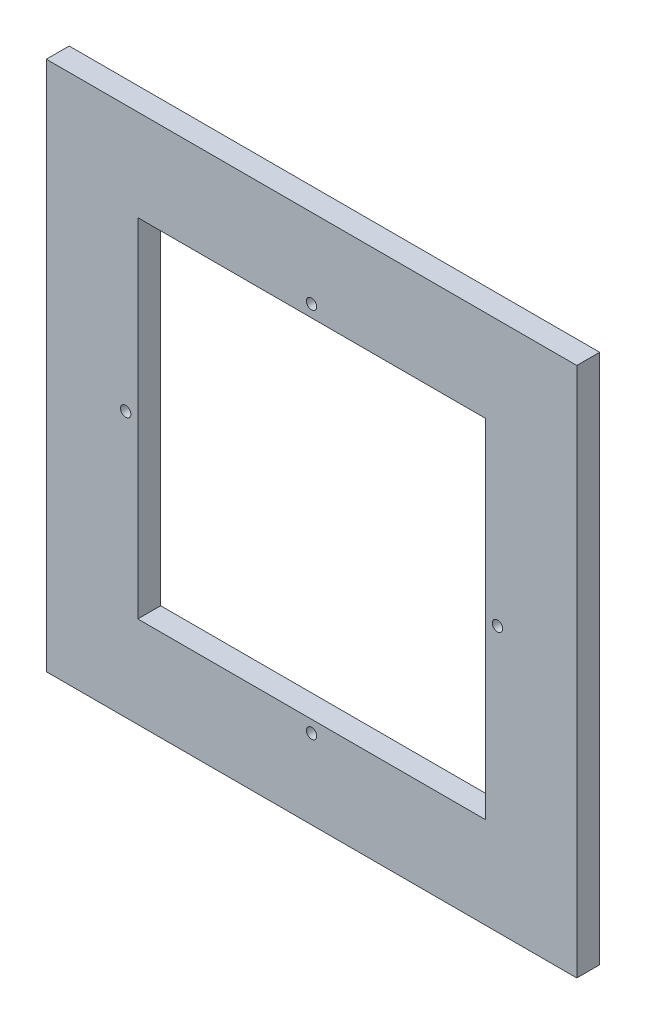
ISO-10303-21;
HEADER;
FILE_DESCRIPTION(('STEP AP214'),'2;1');
FILE_NAME('part.step','',(''),(''),'','','');
FILE_SCHEMA(('AUTOMOTIVE_DESIGN { 1 0 10303 214 1 1 1 1 }'));
ENDSEC;
DATA;
#1=APPLICATION_CONTEXT('core data for automotive mechanical design processes');
#2=APPLICATION_PROTOCOL_DEFINITION('international standard','automotive_design',2000,#1);
#3=PRODUCT_CONTEXT('',#1,'mechanical');
#4=PRODUCT('Part','Part','',(#3));
#5=PRODUCT_RELATED_PRODUCT_CATEGORY('part','',(#4));
#6=PRODUCT_DEFINITION_FORMATION('','',#4);
#7=PRODUCT_DEFINITION_CONTEXT('part definition',#1,'design');
#8=PRODUCT_DEFINITION('design','',#6,#7);
#9=PRODUCT_DEFINITION_SHAPE('','',#8);
#10=(LENGTH_UNIT() NAMED_UNIT(*) SI_UNIT(.MILLI.,.METRE.));
#11=(NAMED_UNIT(*) PLANE_ANGLE_UNIT() SI_UNIT($,.RADIAN.));
#12=(NAMED_UNIT(*) SI_UNIT($,.STERADIAN.) SOLID_ANGLE_UNIT());
#13=UNCERTAINTY_MEASURE_WITH_UNIT(LENGTH_MEASURE(1.E-05),#10,'distance_accuracy_value','');
#14=(GEOMETRIC_REPRESENTATION_CONTEXT(3) GLOBAL_UNCERTAINTY_ASSIGNED_CONTEXT((#13)) GLOBAL_UNIT_ASSIGNED_CONTEXT((#10,
#11,#12)) REPRESENTATION_CONTEXT('',''));
#15=CARTESIAN_POINT('',(0.,0.,0.));
#16=DIRECTION('',(0.,0.,1.));
#17=DIRECTION('',(1.,0.,0.));
#18=AXIS2_PLACEMENT_3D('',#15,#16,#17);
#19=CARTESIAN_POINT('',(73.66,0.,6.35));
#20=DIRECTION('',(1.,0.,0.));
#21=DIRECTION('',(0.,1.,0.));
#22=AXIS2_PLACEMENT_3D('',#19,#20,#21);
#23=PLANE('',#22);
#24=DIRECTION('',(0.,-1.,0.));
#25=VECTOR('',#24,1.);
#26=CARTESIAN_POINT('',(73.66,0.,0.));
#27=LINE('',#26,#25);
#28=CARTESIAN_POINT('',(73.66,73.66,0.));
#29=VERTEX_POINT('',#28);
#30=CARTESIAN_POINT('',(73.66,-73.66,0.));
#31=VERTEX_POINT('',#30);
#32=EDGE_CURVE('E158',#29,#31,#27,.T.);
#33=ORIENTED_EDGE('',*,*,#32,.F.);
#34=DIRECTION('',(0.,0.,-1.));
#35=VECTOR('',#34,1.);
#36=CARTESIAN_POINT('',(73.66,73.66,6.35));
#37=LINE('',#36,#35);
#38=CARTESIAN_POINT('',(73.66,73.66,6.35));
#39=VERTEX_POINT('',#38);
#40=EDGE_CURVE('E11',#39,#29,#37,.T.);
#41=ORIENTED_EDGE('',*,*,#40,.F.);
#42=DIRECTION('',(0.,-1.,0.));
#43=VECTOR('',#42,1.);
#44=CARTESIAN_POINT('',(73.66,0.,6.35));
#45=LINE('',#44,#43);
#46=CARTESIAN_POINT('',(73.66,-73.66,6.35));
#47=VERTEX_POINT('',#46);
#48=EDGE_CURVE('E129',#39,#47,#45,.T.);
#49=ORIENTED_EDGE('',*,*,#48,.T.);
#50=DIRECTION('',(0.,0.,-1.));
#51=VECTOR('',#50,1.);
#52=CARTESIAN_POINT('',(73.66,-73.66,6.35));
#53=LINE('',#52,#51);
#54=EDGE_CURVE('E56',#47,#31,#53,.T.);
#55=ORIENTED_EDGE('',*,*,#54,.T.);
#56=EDGE_LOOP('',(#33,#41,#49,#55));
#57=FACE_BOUND('',#56,.T.);
#58=ADVANCED_FACE('F37',(#57),#23,.T.);
#59=CARTESIAN_POINT('',(0.,73.66,6.35));
#60=DIRECTION('',(0.,1.,0.));
#61=DIRECTION('',(0.,0.,1.));
#62=AXIS2_PLACEMENT_3D('',#59,#60,#61);
#63=PLANE('',#62);
#64=DIRECTION('',(1.,0.,0.));
#65=VECTOR('',#64,1.);
#66=CARTESIAN_POINT('',(0.,73.66,0.));
#67=LINE('',#66,#65);
#68=CARTESIAN_POINT('',(-73.66,73.66,0.));
#69=VERTEX_POINT('',#68);
#70=EDGE_CURVE('E116',#69,#29,#67,.T.);
#71=ORIENTED_EDGE('',*,*,#70,.F.);
#72=DIRECTION('',(0.,0.,-1.));
#73=VECTOR('',#72,1.);
#74=CARTESIAN_POINT('',(-73.66,73.66,6.35));
#75=LINE('',#74,#73);
#76=CARTESIAN_POINT('',(-73.66,73.66,6.35));
#77=VERTEX_POINT('',#76);
#78=EDGE_CURVE('E47',#77,#69,#75,.T.);
#79=ORIENTED_EDGE('',*,*,#78,.F.);
#80=DIRECTION('',(1.,0.,0.));
#81=VECTOR('',#80,1.);
#82=CARTESIAN_POINT('',(0.,73.66,6.35));
#83=LINE('',#82,#81);
#84=EDGE_CURVE('E114',#77,#39,#83,.T.);
#85=ORIENTED_EDGE('',*,*,#84,.T.);
#86=ORIENTED_EDGE('',*,*,#40,.T.);
#87=EDGE_LOOP('',(#71,#79,#85,#86));
#88=FACE_BOUND('',#87,.T.);
#89=ADVANCED_FACE('F112',(#88),#63,.T.);
#90=CARTESIAN_POINT('',(-73.66,0.,6.35));
#91=DIRECTION('',(1.,0.,0.));
#92=DIRECTION('',(0.,0.,-1.));
#93=AXIS2_PLACEMENT_3D('',#90,#91,#92);
#94=PLANE('',#93);
#95=DIRECTION('',(0.,-1.,0.));
#96=VECTOR('',#95,1.);
#97=CARTESIAN_POINT('',(-73.66,0.,0.));
#98=LINE('',#97,#96);
#99=CARTESIAN_POINT('',(-73.66,-73.66,0.));
#100=VERTEX_POINT('',#99);
#101=EDGE_CURVE('E161',#69,#100,#98,.T.);
#102=ORIENTED_EDGE('',*,*,#101,.T.);
#103=DIRECTION('',(0.,0.,-1.));
#104=VECTOR('',#103,1.);
#105=CARTESIAN_POINT('',(-73.66,-73.66,6.35));
#106=LINE('',#105,#104);
#107=CARTESIAN_POINT('',(-73.66,-73.66,6.35));
#108=VERTEX_POINT('',#107);
#109=EDGE_CURVE('E82',#108,#100,#106,.T.);
#110=ORIENTED_EDGE('',*,*,#109,.F.);
#111=DIRECTION('',(0.,-1.,0.));
#112=VECTOR('',#111,1.);
#113=CARTESIAN_POINT('',(-73.66,0.,6.35));
#114=LINE('',#113,#112);
#115=EDGE_CURVE('E120',#77,#108,#114,.T.);
#116=ORIENTED_EDGE('',*,*,#115,.F.);
#117=ORIENTED_EDGE('',*,*,#78,.T.);
#118=EDGE_LOOP('',(#102,#110,#116,#117));
#119=FACE_BOUND('',#118,.T.);
#120=ADVANCED_FACE('F121',(#119),#94,.F.);
#121=CARTESIAN_POINT('',(48.26,0.,6.35));
#122=DIRECTION('',(1.,0.,0.));
#123=DIRECTION('',(0.,1.,0.));
#124=AXIS2_PLACEMENT_3D('',#121,#122,#123);
#125=PLANE('',#124);
#126=DIRECTION('',(0.,-1.,0.));
#127=VECTOR('',#126,1.);
#128=CARTESIAN_POINT('',(48.26,0.,0.));
#129=LINE('',#128,#127);
#130=CARTESIAN_POINT('',(48.26,48.26,0.));
#131=VERTEX_POINT('',#130);
#132=CARTESIAN_POINT('',(48.26,-48.26,0.));
#133=VERTEX_POINT('',#132);
#134=EDGE_CURVE('E146',#131,#133,#129,.T.);
#135=ORIENTED_EDGE('',*,*,#134,.T.);
#136=DIRECTION('',(0.,0.,-1.));
#137=VECTOR('',#136,1.);
#138=CARTESIAN_POINT('',(48.26,-48.26,6.35));
#139=LINE('',#138,#137);
#140=CARTESIAN_POINT('',(48.26,-48.26,6.35));
#141=VERTEX_POINT('',#140);
#142=EDGE_CURVE('E41',#141,#133,#139,.T.);
#143=ORIENTED_EDGE('',*,*,#142,.F.);
#144=DIRECTION('',(0.,-1.,0.));
#145=VECTOR('',#144,1.);
#146=CARTESIAN_POINT('',(48.26,0.,6.35));
#147=LINE('',#146,#145);
#148=CARTESIAN_POINT('',(48.26,48.26,6.35));
#149=VERTEX_POINT('',#148);
#150=EDGE_CURVE('E175',#149,#141,#147,.T.);
#151=ORIENTED_EDGE('',*,*,#150,.F.);
#152=DIRECTION('',(0.,0.,-1.));
#153=VECTOR('',#152,1.);
#154=CARTESIAN_POINT('',(48.26,48.26,6.35));
#155=LINE('',#154,#153);
#156=EDGE_CURVE('E145',#149,#131,#155,.T.);
#157=ORIENTED_EDGE('',*,*,#156,.T.);
#158=EDGE_LOOP('',(#135,#143,#151,#157));
#159=FACE_BOUND('',#158,.T.);
#160=ADVANCED_FACE('F39',(#159),#125,.F.);
#161=CARTESIAN_POINT('',(0.,-48.26,6.35));
#162=DIRECTION('',(0.,-1.,0.));
#163=DIRECTION('',(1.,0.,0.));
#164=AXIS2_PLACEMENT_3D('',#161,#162,#163);
#165=PLANE('',#164);
#166=DIRECTION('',(-1.,0.,0.));
#167=VECTOR('',#166,1.);
#168=CARTESIAN_POINT('',(0.,-48.26,0.));
#169=LINE('',#168,#167);
#170=CARTESIAN_POINT('',(-48.26,-48.26,0.));
#171=VERTEX_POINT('',#170);
#172=EDGE_CURVE('E149',#133,#171,#169,.T.);
#173=ORIENTED_EDGE('',*,*,#172,.T.);
#174=DIRECTION('',(0.,0.,-1.));
#175=VECTOR('',#174,1.);
#176=CARTESIAN_POINT('',(-48.26,-48.26,6.35));
#177=LINE('',#176,#175);
#178=CARTESIAN_POINT('',(-48.26,-48.26,6.35));
#179=VERTEX_POINT('',#178);
#180=EDGE_CURVE('E182',#179,#171,#177,.T.);
#181=ORIENTED_EDGE('',*,*,#180,.F.);
#182=DIRECTION('',(-1.,0.,0.));
#183=VECTOR('',#182,1.);
#184=CARTESIAN_POINT('',(0.,-48.26,6.35));
#185=LINE('',#184,#183);
#186=EDGE_CURVE('E95',#141,#179,#185,.T.);
#187=ORIENTED_EDGE('',*,*,#186,.F.);
#188=ORIENTED_EDGE('',*,*,#142,.T.);
#189=EDGE_LOOP('',(#173,#181,#187,#188));
#190=FACE_BOUND('',#189,.T.);
#191=ADVANCED_FACE('F188',(#190),#165,.F.);
#192=CARTESIAN_POINT('',(-48.26,0.,6.35));
#193=DIRECTION('',(-1.,0.,0.));
#194=DIRECTION('',(0.,0.,1.));
#195=AXIS2_PLACEMENT_3D('',#192,#193,#194);
#196=PLANE('',#195);
#197=DIRECTION('',(0.,1.,0.));
#198=VECTOR('',#197,1.);
#199=CARTESIAN_POINT('',(-48.26,0.,0.));
#200=LINE('',#199,#198);
#201=CARTESIAN_POINT('',(-48.26,48.26,0.));
#202=VERTEX_POINT('',#201);
#203=EDGE_CURVE('E151',#171,#202,#200,.T.);
#204=ORIENTED_EDGE('',*,*,#203,.T.);
#205=DIRECTION('',(0.,0.,-1.));
#206=VECTOR('',#205,1.);
#207=CARTESIAN_POINT('',(-48.26,48.26,6.35));
#208=LINE('',#207,#206);
#209=CARTESIAN_POINT('',(-48.26,48.26,6.35));
#210=VERTEX_POINT('',#209);
#211=EDGE_CURVE('E180',#210,#202,#208,.T.);
#212=ORIENTED_EDGE('',*,*,#211,.F.);
#213=DIRECTION('',(0.,1.,0.));
#214=VECTOR('',#213,1.);
#215=CARTESIAN_POINT('',(-48.26,0.,6.35));
#216=LINE('',#215,#214);
#217=EDGE_CURVE('E204',#179,#210,#216,.T.);
#218=ORIENTED_EDGE('',*,*,#217,.F.);
#219=ORIENTED_EDGE('',*,*,#180,.T.);
#220=EDGE_LOOP('',(#204,#212,#218,#219));
#221=FACE_BOUND('',#220,.T.);
#222=ADVANCED_FACE('F198',(#221),#196,.F.);
#223=CARTESIAN_POINT('',(-51.6254999999985,-1.46728496019932E-12,6.35));
#224=DIRECTION('',(0.,0.,-1.));
#225=DIRECTION('',(-1.,0.,0.));
#226=AXIS2_PLACEMENT_3D('',#223,#224,#225);
#227=CYLINDRICAL_SURFACE('',#226,1.43510000000235);
#228=CARTESIAN_POINT('',(-51.6254999999985,-1.46728496019932E-12,6.35));
#229=DIRECTION('',(0.,0.,1.));
#230=DIRECTION('',(1.,0.,0.));
#231=AXIS2_PLACEMENT_3D('',#228,#229,#230);
#232=CIRCLE('',#231,1.43510000000235);
#233=CARTESIAN_POINT('',(-50.1903999999962,-1.46728496019932E-12,6.35));
#234=VERTEX_POINT('',#233);
#235=EDGE_CURVE('E139',#234,#234,#232,.T.);
#236=ORIENTED_EDGE('',*,*,#235,.T.);
#237=EDGE_LOOP('',(#236));
#238=FACE_BOUND('',#237,.T.);
#239=CARTESIAN_POINT('',(-51.6254999999985,-1.46728496019932E-12,0.));
#240=DIRECTION('',(0.,0.,1.));
#241=DIRECTION('',(1.,0.,0.));
#242=AXIS2_PLACEMENT_3D('',#239,#240,#241);
#243=CIRCLE('',#242,1.43510000000235);
#244=CARTESIAN_POINT('',(-50.1903999999962,-1.46728496019932E-12,0.));
#245=VERTEX_POINT('',#244);
#246=EDGE_CURVE('E169',#245,#245,#243,.T.);
#247=ORIENTED_EDGE('',*,*,#246,.F.);
#248=EDGE_LOOP('',(#247));
#249=FACE_BOUND('',#248,.T.);
#250=ADVANCED_FACE('F249',(#238,#249),#227,.F.);
#251=CARTESIAN_POINT('',(51.6255000000015,1.46096265986638E-12,6.35));
#252=DIRECTION('',(0.,0.,-1.));
#253=DIRECTION('',(-1.,0.,0.));
#254=AXIS2_PLACEMENT_3D('',#251,#252,#253);
#255=CYLINDRICAL_SURFACE('',#254,1.43510000000114);
#256=CARTESIAN_POINT('',(51.6255000000015,1.46096265986638E-12,6.35));
#257=DIRECTION('',(0.,0.,1.));
#258=DIRECTION('',(1.,0.,0.));
#259=AXIS2_PLACEMENT_3D('',#256,#257,#258);
#260=CIRCLE('',#259,1.43510000000114);
#261=CARTESIAN_POINT('',(53.0606000000026,1.46096265986638E-12,6.35));
#262=VERTEX_POINT('',#261);
#263=EDGE_CURVE('E136',#262,#262,#260,.T.);
#264=ORIENTED_EDGE('',*,*,#263,.T.);
#265=EDGE_LOOP('',(#264));
#266=FACE_BOUND('',#265,.T.);
#267=CARTESIAN_POINT('',(51.6255000000015,1.46096265986638E-12,0.));
#268=DIRECTION('',(0.,0.,1.));
#269=DIRECTION('',(1.,0.,0.));
#270=AXIS2_PLACEMENT_3D('',#267,#268,#269);
#271=CIRCLE('',#270,1.43510000000114);
#272=CARTESIAN_POINT('',(53.0606000000026,1.46096265986638E-12,0.));
#273=VERTEX_POINT('',#272);
#274=EDGE_CURVE('E166',#273,#273,#271,.T.);
#275=ORIENTED_EDGE('',*,*,#274,.F.);
#276=EDGE_LOOP('',(#275));
#277=FACE_BOUND('',#276,.T.);
#278=ADVANCED_FACE('F262',(#266,#277),#255,.F.);
#279=CARTESIAN_POINT('',(0.,-73.66,6.35));
#280=DIRECTION('',(0.,-1.,0.));
#281=DIRECTION('',(1.,0.,0.));
#282=AXIS2_PLACEMENT_3D('',#279,#280,#281);
#283=PLANE('',#282);
#284=DIRECTION('',(-1.,0.,0.));
#285=VECTOR('',#284,1.);
#286=CARTESIAN_POINT('',(0.,-73.66,0.));
#287=LINE('',#286,#285);
#288=EDGE_CURVE('E163',#31,#100,#287,.T.);
#289=ORIENTED_EDGE('',*,*,#288,.F.);
#290=ORIENTED_EDGE('',*,*,#54,.F.);
#291=DIRECTION('',(-1.,0.,0.));
#292=VECTOR('',#291,1.);
#293=CARTESIAN_POINT('',(0.,-73.66,6.35));
#294=LINE('',#293,#292);
#295=EDGE_CURVE('E124',#47,#108,#294,.T.);
#296=ORIENTED_EDGE('',*,*,#295,.T.);
#297=ORIENTED_EDGE('',*,*,#109,.T.);
#298=EDGE_LOOP('',(#289,#290,#296,#297));
#299=FACE_BOUND('',#298,.T.);
#300=ADVANCED_FACE('F219',(#299),#283,.T.);
#301=CARTESIAN_POINT('',(0.,51.6255,6.35));
#302=DIRECTION('',(0.,0.,-1.));
#303=DIRECTION('',(-1.,0.,0.));
#304=AXIS2_PLACEMENT_3D('',#301,#302,#303);
#305=CYLINDRICAL_SURFACE('',#304,1.4351);
#306=CARTESIAN_POINT('',(0.,51.6255,6.35));
#307=DIRECTION('',(0.,0.,1.));
#308=DIRECTION('',(1.,0.,0.));
#309=AXIS2_PLACEMENT_3D('',#306,#307,#308);
#310=CIRCLE('',#309,1.4351);
#311=CARTESIAN_POINT('',(1.4351,51.6255,6.35));
#312=VERTEX_POINT('',#311);
#313=EDGE_CURVE('E131',#312,#312,#310,.T.);
#314=ORIENTED_EDGE('',*,*,#313,.T.);
#315=EDGE_LOOP('',(#314));
#316=FACE_BOUND('',#315,.T.);
#317=CARTESIAN_POINT('',(0.,51.6255,0.));
#318=DIRECTION('',(0.,0.,1.));
#319=DIRECTION('',(1.,0.,0.));
#320=AXIS2_PLACEMENT_3D('',#317,#318,#319);
#321=CIRCLE('',#320,1.4351);
#322=CARTESIAN_POINT('',(1.4351,51.6255,0.));
#323=VERTEX_POINT('',#322);
#324=EDGE_CURVE('E155',#323,#323,#321,.T.);
#325=ORIENTED_EDGE('',*,*,#324,.F.);
#326=EDGE_LOOP('',(#325));
#327=FACE_BOUND('',#326,.T.);
#328=ADVANCED_FACE('F216',(#316,#327),#305,.F.);
#329=CARTESIAN_POINT('',(0.,48.26,6.35));
#330=DIRECTION('',(0.,1.,0.));
#331=DIRECTION('',(0.,0.,1.));
#332=AXIS2_PLACEMENT_3D('',#329,#330,#331);
#333=PLANE('',#332);
#334=DIRECTION('',(1.,0.,0.));
#335=VECTOR('',#334,1.);
#336=CARTESIAN_POINT('',(0.,48.26,0.));
#337=LINE('',#336,#335);
#338=EDGE_CURVE('E153',#202,#131,#337,.T.);
#339=ORIENTED_EDGE('',*,*,#338,.T.);
#340=ORIENTED_EDGE('',*,*,#156,.F.);
#341=DIRECTION('',(1.,0.,0.));
#342=VECTOR('',#341,1.);
#343=CARTESIAN_POINT('',(0.,48.26,6.35));
#344=LINE('',#343,#342);
#345=EDGE_CURVE('E202',#210,#149,#344,.T.);
#346=ORIENTED_EDGE('',*,*,#345,.F.);
#347=ORIENTED_EDGE('',*,*,#211,.T.);
#348=EDGE_LOOP('',(#339,#340,#346,#347));
#349=FACE_BOUND('',#348,.T.);
#350=ADVANCED_FACE('F201',(#349),#333,.F.);
#351=CARTESIAN_POINT('',(2.92192531973277E-12,-51.6255,6.35));
#352=DIRECTION('',(0.,0.,-1.));
#353=DIRECTION('',(-1.,0.,0.));
#354=AXIS2_PLACEMENT_3D('',#351,#352,#353);
#355=CYLINDRICAL_SURFACE('',#354,1.43510000000314);
#356=CARTESIAN_POINT('',(2.92192531973277E-12,-51.6255,6.35));
#357=DIRECTION('',(0.,0.,1.));
#358=DIRECTION('',(1.,0.,0.));
#359=AXIS2_PLACEMENT_3D('',#356,#357,#358);
#360=CIRCLE('',#359,1.43510000000314);
#361=CARTESIAN_POINT('',(1.43510000000606,-51.6255,6.35));
#362=VERTEX_POINT('',#361);
#363=EDGE_CURVE('E142',#362,#362,#360,.T.);
#364=ORIENTED_EDGE('',*,*,#363,.T.);
#365=EDGE_LOOP('',(#364));
#366=FACE_BOUND('',#365,.T.);
#367=CARTESIAN_POINT('',(2.92192531973277E-12,-51.6255,0.));
#368=DIRECTION('',(0.,0.,1.));
#369=DIRECTION('',(1.,0.,0.));
#370=AXIS2_PLACEMENT_3D('',#367,#368,#369);
#371=CIRCLE('',#370,1.43510000000314);
#372=CARTESIAN_POINT('',(1.43510000000606,-51.6255,0.));
#373=VERTEX_POINT('',#372);
#374=EDGE_CURVE('E172',#373,#373,#371,.T.);
#375=ORIENTED_EDGE('',*,*,#374,.F.);
#376=EDGE_LOOP('',(#375));
#377=FACE_BOUND('',#376,.T.);
#378=ADVANCED_FACE('F212',(#366,#377),#355,.F.);
#379=CARTESIAN_POINT('',(0.,0.,6.35));
#380=DIRECTION('',(0.,0.,1.));
#381=DIRECTION('',(1.,0.,0.));
#382=AXIS2_PLACEMENT_3D('',#379,#380,#381);
#383=PLANE('',#382);
#384=ORIENTED_EDGE('',*,*,#150,.T.);
#385=ORIENTED_EDGE('',*,*,#186,.T.);
#386=ORIENTED_EDGE('',*,*,#217,.T.);
#387=ORIENTED_EDGE('',*,*,#345,.T.);
#388=EDGE_LOOP('',(#384,#385,#386,#387));
#389=FACE_BOUND('',#388,.T.);
#390=ORIENTED_EDGE('',*,*,#313,.F.);
#391=EDGE_LOOP('',(#390));
#392=FACE_BOUND('',#391,.T.);
#393=ORIENTED_EDGE('',*,*,#48,.F.);
#394=ORIENTED_EDGE('',*,*,#84,.F.);
#395=ORIENTED_EDGE('',*,*,#115,.T.);
#396=ORIENTED_EDGE('',*,*,#295,.F.);
#397=EDGE_LOOP('',(#393,#394,#395,#396));
#398=FACE_BOUND('',#397,.T.);
#399=ORIENTED_EDGE('',*,*,#263,.F.);
#400=EDGE_LOOP('',(#399));
#401=FACE_BOUND('',#400,.T.);
#402=ORIENTED_EDGE('',*,*,#235,.F.);
#403=EDGE_LOOP('',(#402));
#404=FACE_BOUND('',#403,.T.);
#405=ORIENTED_EDGE('',*,*,#363,.F.);
#406=EDGE_LOOP('',(#405));
#407=FACE_BOUND('',#406,.T.);
#408=ADVANCED_FACE('F127',(#389,#392,#398,#401,#404,#407),#383,.T.);
#409=CARTESIAN_POINT('',(0.,0.,0.));
#410=DIRECTION('',(0.,0.,1.));
#411=DIRECTION('',(1.,0.,0.));
#412=AXIS2_PLACEMENT_3D('',#409,#410,#411);
#413=PLANE('',#412);
#414=ORIENTED_EDGE('',*,*,#134,.F.);
#415=ORIENTED_EDGE('',*,*,#338,.F.);
#416=ORIENTED_EDGE('',*,*,#203,.F.);
#417=ORIENTED_EDGE('',*,*,#172,.F.);
#418=EDGE_LOOP('',(#414,#415,#416,#417));
#419=FACE_BOUND('',#418,.T.);
#420=ORIENTED_EDGE('',*,*,#324,.T.);
#421=EDGE_LOOP('',(#420));
#422=FACE_BOUND('',#421,.T.);
#423=ORIENTED_EDGE('',*,*,#32,.T.);
#424=ORIENTED_EDGE('',*,*,#288,.T.);
#425=ORIENTED_EDGE('',*,*,#101,.F.);
#426=ORIENTED_EDGE('',*,*,#70,.T.);
#427=EDGE_LOOP('',(#423,#424,#425,#426));
#428=FACE_BOUND('',#427,.T.);
#429=ORIENTED_EDGE('',*,*,#274,.T.);
#430=EDGE_LOOP('',(#429));
#431=FACE_BOUND('',#430,.T.);
#432=ORIENTED_EDGE('',*,*,#246,.T.);
#433=EDGE_LOOP('',(#432));
#434=FACE_BOUND('',#433,.T.);
#435=ORIENTED_EDGE('',*,*,#374,.T.);
#436=EDGE_LOOP('',(#435));
#437=FACE_BOUND('',#436,.T.);
#438=ADVANCED_FACE('F195',(#419,#422,#428,#431,#434,#437),#413,.F.);
#439=CLOSED_SHELL('',(#58,#89,#120,#160,#191,#222,#250,#278,#300,#328,#350,#378,#408,#438));
#440=MANIFOLD_SOLID_BREP('B2',#439);
#441=ADVANCED_BREP_SHAPE_REPRESENTATION('',(#18,#440),#14);
#442=SHAPE_DEFINITION_REPRESENTATION(#9,#441);
ENDSEC;
END-ISO-10303-21;
